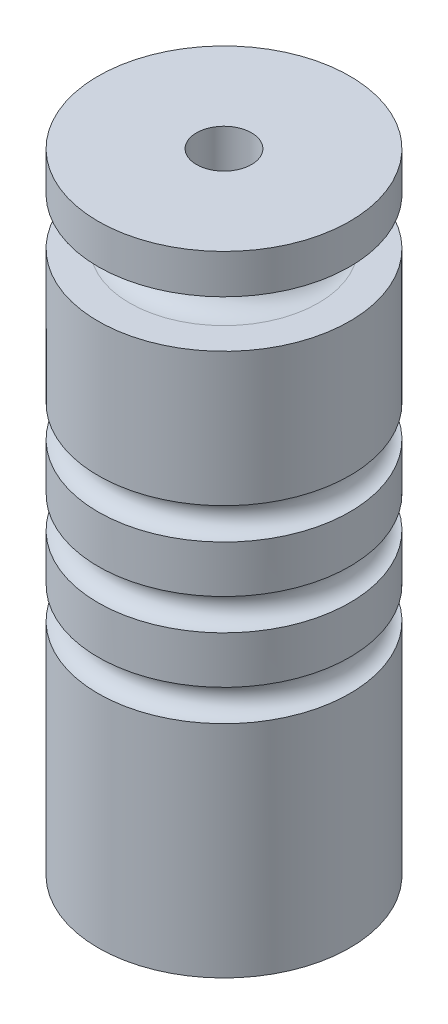
ISO-10303-21;
HEADER;
FILE_DESCRIPTION(('STEP AP214'),'2;1');
FILE_NAME('part.step','',(''),(''),'','','');
FILE_SCHEMA(('AUTOMOTIVE_DESIGN { 1 0 10303 214 1 1 1 1 }'));
ENDSEC;
DATA;
#1=APPLICATION_CONTEXT('core data for automotive mechanical design processes');
#2=APPLICATION_PROTOCOL_DEFINITION('international standard','automotive_design',2000,#1);
#3=PRODUCT_CONTEXT('',#1,'mechanical');
#4=PRODUCT('Part','Part','',(#3));
#5=PRODUCT_RELATED_PRODUCT_CATEGORY('part','',(#4));
#6=PRODUCT_DEFINITION_FORMATION('','',#4);
#7=PRODUCT_DEFINITION_CONTEXT('part definition',#1,'design');
#8=PRODUCT_DEFINITION('design','',#6,#7);
#9=PRODUCT_DEFINITION_SHAPE('','',#8);
#10=(LENGTH_UNIT() NAMED_UNIT(*) SI_UNIT(.MILLI.,.METRE.));
#11=(NAMED_UNIT(*) PLANE_ANGLE_UNIT() SI_UNIT($,.RADIAN.));
#12=(NAMED_UNIT(*) SI_UNIT($,.STERADIAN.) SOLID_ANGLE_UNIT());
#13=UNCERTAINTY_MEASURE_WITH_UNIT(LENGTH_MEASURE(1.E-05),#10,'distance_accuracy_value','');
#14=(GEOMETRIC_REPRESENTATION_CONTEXT(3) GLOBAL_UNCERTAINTY_ASSIGNED_CONTEXT((#13)) GLOBAL_UNIT_ASSIGNED_CONTEXT((#10,
#11,#12)) REPRESENTATION_CONTEXT('',''));
#15=CARTESIAN_POINT('',(0.,0.,0.));
#16=DIRECTION('',(0.,0.,1.));
#17=DIRECTION('',(1.,0.,0.));
#18=AXIS2_PLACEMENT_3D('',#15,#16,#17);
#19=CARTESIAN_POINT('',(0.,40.,0.));
#20=DIRECTION('',(0.,-1.,0.));
#21=DIRECTION('',(0.,0.,-1.));
#22=AXIS2_PLACEMENT_3D('',#19,#20,#21);
#23=CYLINDRICAL_SURFACE('',#22,8.);
#24=CARTESIAN_POINT('',(0.,34.5,0.));
#25=DIRECTION('',(0.,-1.,0.));
#26=DIRECTION('',(0.,0.,-1.));
#27=AXIS2_PLACEMENT_3D('',#24,#25,#26);
#28=CIRCLE('',#27,8.);
#29=CARTESIAN_POINT('',(0.,34.5,-8.));
#30=VERTEX_POINT('',#29);
#31=EDGE_CURVE('E33',#30,#30,#28,.T.);
#32=ORIENTED_EDGE('',*,*,#31,.T.);
#33=EDGE_LOOP('',(#32));
#34=FACE_BOUND('',#33,.T.);
#35=CARTESIAN_POINT('',(0.,26.,0.));
#36=DIRECTION('',(0.,-1.,0.));
#37=DIRECTION('',(0.,0.,-1.));
#38=AXIS2_PLACEMENT_3D('',#35,#36,#37);
#39=CIRCLE('',#38,8.);
#40=CARTESIAN_POINT('',(0.,26.,-8.));
#41=VERTEX_POINT('',#40);
#42=EDGE_CURVE('E59',#41,#41,#39,.F.);
#43=ORIENTED_EDGE('',*,*,#42,.T.);
#44=EDGE_LOOP('',(#43));
#45=FACE_BOUND('',#44,.T.);
#46=ADVANCED_FACE('F29',(#34,#45),#23,.T.);
#47=CARTESIAN_POINT('',(0.,14.,0.));
#48=DIRECTION('',(0.,1.,0.));
#49=DIRECTION('',(0.,0.,1.));
#50=AXIS2_PLACEMENT_3D('',#47,#48,#49);
#51=CIRCLE('',#50,8.);
#52=CARTESIAN_POINT('',(0.,14.,8.));
#53=VERTEX_POINT('',#52);
#54=EDGE_CURVE('E62',#53,#53,#51,.F.);
#55=ORIENTED_EDGE('',*,*,#54,.T.);
#56=EDGE_LOOP('',(#55));
#57=FACE_BOUND('',#56,.T.);
#58=CARTESIAN_POINT('',(0.,0.,0.));
#59=DIRECTION('',(0.,1.,0.));
#60=DIRECTION('',(0.,0.,1.));
#61=AXIS2_PLACEMENT_3D('',#58,#59,#60);
#62=CIRCLE('',#61,8.);
#63=CARTESIAN_POINT('',(0.,0.,8.));
#64=VERTEX_POINT('',#63);
#65=EDGE_CURVE('E37',#64,#64,#62,.T.);
#66=ORIENTED_EDGE('',*,*,#65,.T.);
#67=EDGE_LOOP('',(#66));
#68=FACE_BOUND('',#67,.T.);
#69=ADVANCED_FACE('F96',(#57,#68),#23,.T.);
#70=CARTESIAN_POINT('',(0.,24.,0.));
#71=DIRECTION('',(0.,1.,0.));
#72=DIRECTION('',(0.,0.,1.));
#73=AXIS2_PLACEMENT_3D('',#70,#71,#72);
#74=CIRCLE('',#73,8.);
#75=CARTESIAN_POINT('',(0.,24.,8.));
#76=VERTEX_POINT('',#75);
#77=EDGE_CURVE('E55',#76,#76,#74,.F.);
#78=ORIENTED_EDGE('',*,*,#77,.T.);
#79=EDGE_LOOP('',(#78));
#80=FACE_BOUND('',#79,.T.);
#81=CARTESIAN_POINT('',(0.,21.,0.));
#82=DIRECTION('',(0.,-1.,0.));
#83=DIRECTION('',(0.,0.,-1.));
#84=AXIS2_PLACEMENT_3D('',#81,#82,#83);
#85=CIRCLE('',#84,8.);
#86=CARTESIAN_POINT('',(0.,21.,-8.));
#87=VERTEX_POINT('',#86);
#88=EDGE_CURVE('E51',#87,#87,#85,.F.);
#89=ORIENTED_EDGE('',*,*,#88,.T.);
#90=EDGE_LOOP('',(#89));
#91=FACE_BOUND('',#90,.T.);
#92=ADVANCED_FACE('F98',(#80,#91),#23,.T.);
#93=CARTESIAN_POINT('',(0.,16.,0.));
#94=DIRECTION('',(0.,-1.,0.));
#95=DIRECTION('',(0.,0.,-1.));
#96=AXIS2_PLACEMENT_3D('',#93,#94,#95);
#97=CIRCLE('',#96,8.);
#98=CARTESIAN_POINT('',(0.,16.,-8.));
#99=VERTEX_POINT('',#98);
#100=EDGE_CURVE('E65',#99,#99,#97,.F.);
#101=ORIENTED_EDGE('',*,*,#100,.T.);
#102=EDGE_LOOP('',(#101));
#103=FACE_BOUND('',#102,.T.);
#104=CARTESIAN_POINT('',(0.,19.,0.));
#105=DIRECTION('',(0.,1.,0.));
#106=DIRECTION('',(0.,0.,1.));
#107=AXIS2_PLACEMENT_3D('',#104,#105,#106);
#108=CIRCLE('',#107,8.);
#109=CARTESIAN_POINT('',(0.,19.,8.));
#110=VERTEX_POINT('',#109);
#111=EDGE_CURVE('E54',#110,#110,#108,.F.);
#112=ORIENTED_EDGE('',*,*,#111,.T.);
#113=EDGE_LOOP('',(#112));
#114=FACE_BOUND('',#113,.T.);
#115=ADVANCED_FACE('F103',(#103,#114),#23,.T.);
#116=CARTESIAN_POINT('',(0.,0.,0.));
#117=DIRECTION('',(0.,1.,0.));
#118=DIRECTION('',(0.,0.,1.));
#119=AXIS2_PLACEMENT_3D('',#116,#117,#118);
#120=CYLINDRICAL_SURFACE('',#119,1.75);
#121=CARTESIAN_POINT('',(0.,40.,0.));
#122=DIRECTION('',(0.,1.,0.));
#123=DIRECTION('',(0.,0.,1.));
#124=AXIS2_PLACEMENT_3D('',#121,#122,#123);
#125=CIRCLE('',#124,1.75);
#126=CARTESIAN_POINT('',(0.,40.,1.75));
#127=VERTEX_POINT('',#126);
#128=EDGE_CURVE('E42',#127,#127,#125,.T.);
#129=ORIENTED_EDGE('',*,*,#128,.T.);
#130=EDGE_LOOP('',(#129));
#131=FACE_BOUND('',#130,.T.);
#132=CARTESIAN_POINT('',(0.,6.35,0.));
#133=DIRECTION('',(0.,-1.,0.));
#134=DIRECTION('',(0.,0.,-1.));
#135=AXIS2_PLACEMENT_3D('',#132,#133,#134);
#136=CIRCLE('',#135,1.75);
#137=CARTESIAN_POINT('',(0.,6.35,-1.75));
#138=VERTEX_POINT('',#137);
#139=EDGE_CURVE('E47',#138,#138,#136,.F.);
#140=ORIENTED_EDGE('',*,*,#139,.F.);
#141=EDGE_LOOP('',(#140));
#142=FACE_BOUND('',#141,.T.);
#143=ADVANCED_FACE('F137',(#131,#142),#120,.F.);
#144=CARTESIAN_POINT('',(0.,37.5,0.));
#145=DIRECTION('',(0.,1.,0.));
#146=DIRECTION('',(0.,0.,1.));
#147=AXIS2_PLACEMENT_3D('',#144,#145,#146);
#148=CIRCLE('',#147,8.);
#149=CARTESIAN_POINT('',(0.,37.5,8.));
#150=VERTEX_POINT('',#149);
#151=EDGE_CURVE('E69',#150,#150,#148,.T.);
#152=ORIENTED_EDGE('',*,*,#151,.T.);
#153=EDGE_LOOP('',(#152));
#154=FACE_BOUND('',#153,.T.);
#155=CARTESIAN_POINT('',(0.,40.,0.));
#156=DIRECTION('',(0.,1.,0.));
#157=DIRECTION('',(0.,0.,1.));
#158=AXIS2_PLACEMENT_3D('',#155,#156,#157);
#159=CIRCLE('',#158,8.);
#160=CARTESIAN_POINT('',(0.,40.,8.));
#161=VERTEX_POINT('',#160);
#162=EDGE_CURVE('E10',#161,#161,#159,.T.);
#163=ORIENTED_EDGE('',*,*,#162,.F.);
#164=EDGE_LOOP('',(#163));
#165=FACE_BOUND('',#164,.T.);
#166=ADVANCED_FACE('F31',(#154,#165),#23,.T.);
#167=CARTESIAN_POINT('',(0.,40.,0.));
#168=DIRECTION('',(0.,1.,0.));
#169=DIRECTION('',(0.,0.,1.));
#170=AXIS2_PLACEMENT_3D('',#167,#168,#169);
#171=PLANE('',#170);
#172=ORIENTED_EDGE('',*,*,#128,.F.);
#173=EDGE_LOOP('',(#172));
#174=FACE_BOUND('',#173,.T.);
#175=ORIENTED_EDGE('',*,*,#162,.T.);
#176=EDGE_LOOP('',(#175));
#177=FACE_BOUND('',#176,.T.);
#178=ADVANCED_FACE('F93',(#174,#177),#171,.T.);
#179=CARTESIAN_POINT('',(0.,0.,0.));
#180=DIRECTION('',(0.,1.,0.));
#181=DIRECTION('',(0.,0.,1.));
#182=AXIS2_PLACEMENT_3D('',#179,#180,#181);
#183=PLANE('',#182);
#184=CARTESIAN_POINT('',(0.,0.,0.));
#185=DIRECTION('',(0.,-1.,0.));
#186=DIRECTION('',(0.,0.,-1.));
#187=AXIS2_PLACEMENT_3D('',#184,#185,#186);
#188=CIRCLE('',#187,4.);
#189=CARTESIAN_POINT('',(0.,0.,-4.));
#190=VERTEX_POINT('',#189);
#191=EDGE_CURVE('E58',#190,#190,#188,.T.);
#192=ORIENTED_EDGE('',*,*,#191,.F.);
#193=EDGE_LOOP('',(#192));
#194=FACE_BOUND('',#193,.T.);
#195=ORIENTED_EDGE('',*,*,#65,.F.);
#196=EDGE_LOOP('',(#195));
#197=FACE_BOUND('',#196,.T.);
#198=ADVANCED_FACE('F89',(#194,#197),#183,.F.);
#199=CARTESIAN_POINT('',(0.,6.35,0.));
#200=DIRECTION('',(0.,-1.,0.));
#201=DIRECTION('',(0.,0.,-1.));
#202=AXIS2_PLACEMENT_3D('',#199,#200,#201);
#203=PLANE('',#202);
#204=CARTESIAN_POINT('',(0.,6.35,0.));
#205=DIRECTION('',(0.,-1.,0.));
#206=DIRECTION('',(0.,0.,-1.));
#207=AXIS2_PLACEMENT_3D('',#204,#205,#206);
#208=CIRCLE('',#207,4.);
#209=CARTESIAN_POINT('',(0.,6.35,-4.));
#210=VERTEX_POINT('',#209);
#211=EDGE_CURVE('E50',#210,#210,#208,.T.);
#212=ORIENTED_EDGE('',*,*,#211,.T.);
#213=EDGE_LOOP('',(#212));
#214=FACE_BOUND('',#213,.T.);
#215=ORIENTED_EDGE('',*,*,#139,.T.);
#216=EDGE_LOOP('',(#215));
#217=FACE_BOUND('',#216,.T.);
#218=ADVANCED_FACE('F92',(#214,#217),#203,.T.);
#219=CARTESIAN_POINT('',(0.,6.35,0.));
#220=DIRECTION('',(0.,-1.,0.));
#221=DIRECTION('',(0.,0.,-1.));
#222=AXIS2_PLACEMENT_3D('',#219,#220,#221);
#223=CYLINDRICAL_SURFACE('',#222,4.);
#224=ORIENTED_EDGE('',*,*,#211,.F.);
#225=EDGE_LOOP('',(#224));
#226=FACE_BOUND('',#225,.T.);
#227=ORIENTED_EDGE('',*,*,#191,.T.);
#228=EDGE_LOOP('',(#227));
#229=FACE_BOUND('',#228,.T.);
#230=ADVANCED_FACE('F87',(#226,#229),#223,.F.);
#231=CARTESIAN_POINT('',(0.,20.,0.));
#232=DIRECTION('',(0.,-1.,0.));
#233=DIRECTION('',(0.,0.,-1.));
#234=AXIS2_PLACEMENT_3D('',#231,#232,#233);
#235=TOROIDAL_SURFACE('',#234,8.,1.);
#236=ORIENTED_EDGE('',*,*,#88,.F.);
#237=EDGE_LOOP('',(#236));
#238=FACE_BOUND('',#237,.T.);
#239=ORIENTED_EDGE('',*,*,#111,.F.);
#240=EDGE_LOOP('',(#239));
#241=FACE_BOUND('',#240,.T.);
#242=ADVANCED_FACE('F122',(#238,#241),#235,.F.);
#243=CARTESIAN_POINT('',(0.,25.,0.));
#244=DIRECTION('',(0.,-1.,0.));
#245=DIRECTION('',(0.,0.,-1.));
#246=AXIS2_PLACEMENT_3D('',#243,#244,#245);
#247=TOROIDAL_SURFACE('',#246,8.,1.);
#248=ORIENTED_EDGE('',*,*,#42,.F.);
#249=EDGE_LOOP('',(#248));
#250=FACE_BOUND('',#249,.T.);
#251=ORIENTED_EDGE('',*,*,#77,.F.);
#252=EDGE_LOOP('',(#251));
#253=FACE_BOUND('',#252,.T.);
#254=ADVANCED_FACE('F112',(#250,#253),#247,.F.);
#255=CARTESIAN_POINT('',(0.,15.,0.));
#256=DIRECTION('',(0.,-1.,0.));
#257=DIRECTION('',(0.,0.,-1.));
#258=AXIS2_PLACEMENT_3D('',#255,#256,#257);
#259=TOROIDAL_SURFACE('',#258,8.,1.);
#260=ORIENTED_EDGE('',*,*,#100,.F.);
#261=EDGE_LOOP('',(#260));
#262=FACE_BOUND('',#261,.T.);
#263=ORIENTED_EDGE('',*,*,#54,.F.);
#264=EDGE_LOOP('',(#263));
#265=FACE_BOUND('',#264,.T.);
#266=ADVANCED_FACE('F109',(#262,#265),#259,.F.);
#267=CARTESIAN_POINT('',(8.5,34.5,0.));
#268=DIRECTION('',(0.,-1.,0.));
#269=DIRECTION('',(0.,0.,-1.));
#270=AXIS2_PLACEMENT_3D('',#267,#268,#269);
#271=PLANE('',#270);
#272=CARTESIAN_POINT('',(0.,34.5,0.));
#273=DIRECTION('',(0.,1.,0.));
#274=DIRECTION('',(0.,0.,1.));
#275=AXIS2_PLACEMENT_3D('',#272,#273,#274);
#276=CIRCLE('',#275,6.);
#277=CARTESIAN_POINT('',(0.,34.5,6.));
#278=VERTEX_POINT('',#277);
#279=EDGE_CURVE('E71',#278,#278,#276,.F.);
#280=ORIENTED_EDGE('',*,*,#279,.T.);
#281=EDGE_LOOP('',(#280));
#282=FACE_BOUND('',#281,.T.);
#283=ORIENTED_EDGE('',*,*,#31,.F.);
#284=EDGE_LOOP('',(#283));
#285=FACE_BOUND('',#284,.T.);
#286=ADVANCED_FACE('F111',(#282,#285),#271,.F.);
#287=CARTESIAN_POINT('',(8.5,37.5,0.));
#288=DIRECTION('',(0.,1.,0.));
#289=DIRECTION('',(0.,0.,1.));
#290=AXIS2_PLACEMENT_3D('',#287,#288,#289);
#291=PLANE('',#290);
#292=CARTESIAN_POINT('',(0.,37.5,0.));
#293=DIRECTION('',(0.,-1.,0.));
#294=DIRECTION('',(0.,0.,-1.));
#295=AXIS2_PLACEMENT_3D('',#292,#293,#294);
#296=CIRCLE('',#295,6.);
#297=CARTESIAN_POINT('',(0.,37.5,-6.));
#298=VERTEX_POINT('',#297);
#299=EDGE_CURVE('E76',#298,#298,#296,.F.);
#300=ORIENTED_EDGE('',*,*,#299,.T.);
#301=EDGE_LOOP('',(#300));
#302=FACE_BOUND('',#301,.T.);
#303=ORIENTED_EDGE('',*,*,#151,.F.);
#304=EDGE_LOOP('',(#303));
#305=FACE_BOUND('',#304,.T.);
#306=ADVANCED_FACE('F120',(#302,#305),#291,.F.);
#307=CARTESIAN_POINT('',(0.,36.,0.));
#308=DIRECTION('',(0.,-1.,0.));
#309=DIRECTION('',(0.,0.,-1.));
#310=AXIS2_PLACEMENT_3D('',#307,#308,#309);
#311=TOROIDAL_SURFACE('',#310,6.,1.5);
#312=ORIENTED_EDGE('',*,*,#299,.F.);
#313=EDGE_LOOP('',(#312));
#314=FACE_BOUND('',#313,.T.);
#315=ORIENTED_EDGE('',*,*,#279,.F.);
#316=EDGE_LOOP('',(#315));
#317=FACE_BOUND('',#316,.T.);
#318=ADVANCED_FACE('F234',(#314,#317),#311,.F.);
#319=CLOSED_SHELL('',(#46,#69,#92,#115,#143,#166,#178,#198,#218,#230,#242,#254,#266,#286,#306,#318));
#320=MANIFOLD_SOLID_BREP('B2',#319);
#321=ADVANCED_BREP_SHAPE_REPRESENTATION('',(#18,#320),#14);
#322=SHAPE_DEFINITION_REPRESENTATION(#9,#321);
ENDSEC;
END-ISO-10303-21;
